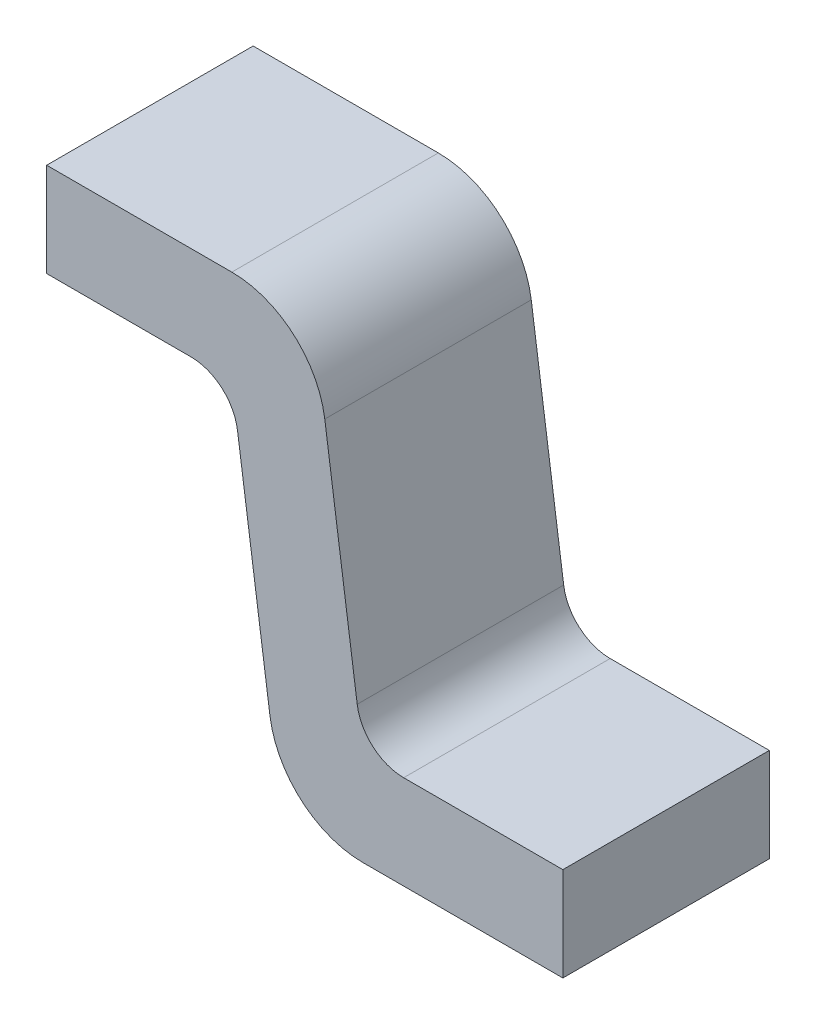
ISO-10303-21;
HEADER;
FILE_DESCRIPTION(('STEP AP214'),'2;1');
FILE_NAME('part.step','',(''),(''),'','','');
FILE_SCHEMA(('AUTOMOTIVE_DESIGN { 1 0 10303 214 1 1 1 1 }'));
ENDSEC;
DATA;
#1=APPLICATION_CONTEXT('core data for automotive mechanical design processes');
#2=APPLICATION_PROTOCOL_DEFINITION('international standard','automotive_design',2000,#1);
#3=PRODUCT_CONTEXT('',#1,'mechanical');
#4=PRODUCT('Part','Part','',(#3));
#5=PRODUCT_RELATED_PRODUCT_CATEGORY('part','',(#4));
#6=PRODUCT_DEFINITION_FORMATION('','',#4);
#7=PRODUCT_DEFINITION_CONTEXT('part definition',#1,'design');
#8=PRODUCT_DEFINITION('design','',#6,#7);
#9=PRODUCT_DEFINITION_SHAPE('','',#8);
#10=(LENGTH_UNIT() NAMED_UNIT(*) SI_UNIT(.MILLI.,.METRE.));
#11=(NAMED_UNIT(*) PLANE_ANGLE_UNIT() SI_UNIT($,.RADIAN.));
#12=(NAMED_UNIT(*) SI_UNIT($,.STERADIAN.) SOLID_ANGLE_UNIT());
#13=UNCERTAINTY_MEASURE_WITH_UNIT(LENGTH_MEASURE(1.E-05),#10,'distance_accuracy_value','');
#14=(GEOMETRIC_REPRESENTATION_CONTEXT(3) GLOBAL_UNCERTAINTY_ASSIGNED_CONTEXT((#13)) GLOBAL_UNIT_ASSIGNED_CONTEXT((#10,
#11,#12)) REPRESENTATION_CONTEXT('',''));
#15=CARTESIAN_POINT('',(0.,0.,0.));
#16=DIRECTION('',(0.,0.,1.));
#17=DIRECTION('',(1.,0.,0.));
#18=AXIS2_PLACEMENT_3D('',#15,#16,#17);
#19=CARTESIAN_POINT('',(0.760786021345,0.3,0.22));
#20=DIRECTION('',(0.,0.,-1.));
#21=DIRECTION('',(-1.,0.,0.));
#22=AXIS2_PLACEMENT_3D('',#19,#20,#21);
#23=PLANE('',#22);
#24=DIRECTION('',(-1.,0.,0.));
#25=VECTOR('',#24,1.);
#26=CARTESIAN_POINT('',(1.1,0.2,0.22));
#27=LINE('',#26,#25);
#28=CARTESIAN_POINT('',(0.760786021345,0.2,0.22));
#29=VERTEX_POINT('',#28);
#30=CARTESIAN_POINT('',(1.1,0.2,0.22));
#31=VERTEX_POINT('',#30);
#32=EDGE_CURVE('E163',#29,#31,#27,.F.);
#33=ORIENTED_EDGE('',*,*,#32,.F.);
#34=CARTESIAN_POINT('',(0.760786021345,0.3,0.22));
#35=DIRECTION('',(0.,0.,1.));
#36=DIRECTION('',(1.,0.,0.));
#37=AXIS2_PLACEMENT_3D('',#34,#35,#36);
#38=CIRCLE('',#37,0.1);
#39=CARTESIAN_POINT('',(0.661759214470982,0.286082689904012,0.22));
#40=VERTEX_POINT('',#39);
#41=EDGE_CURVE('E172',#29,#40,#38,.F.);
#42=ORIENTED_EDGE('',*,*,#41,.T.);
#43=DIRECTION('',(-0.139173100959942,0.990268068741588,0.));
#44=VECTOR('',#43,1.);
#45=CARTESIAN_POINT('',(0.592647987722,0.777834620192,0.22));
#46=LINE('',#45,#44);
#47=CARTESIAN_POINT('',(0.592647987721994,0.777834620192041,0.22));
#48=VERTEX_POINT('',#47);
#49=EDGE_CURVE('E169',#48,#40,#46,.F.);
#50=ORIENTED_EDGE('',*,*,#49,.F.);
#51=CARTESIAN_POINT('',(0.394594373973,0.75,0.22));
#52=DIRECTION('',(0.,0.,1.));
#53=DIRECTION('',(1.,0.,0.));
#54=AXIS2_PLACEMENT_3D('',#51,#52,#53);
#55=CIRCLE('',#54,0.2);
#56=CARTESIAN_POINT('',(0.394594373973,0.95,0.22));
#57=VERTEX_POINT('',#56);
#58=EDGE_CURVE('E205',#57,#48,#55,.F.);
#59=ORIENTED_EDGE('',*,*,#58,.F.);
#60=DIRECTION('',(-1.,0.,0.));
#61=VECTOR('',#60,1.);
#62=CARTESIAN_POINT('',(0.,0.95,0.22));
#63=LINE('',#62,#61);
#64=CARTESIAN_POINT('',(0.,0.95,0.22));
#65=VERTEX_POINT('',#64);
#66=EDGE_CURVE('E129',#65,#57,#63,.F.);
#67=ORIENTED_EDGE('',*,*,#66,.F.);
#68=DIRECTION('',(0.,-1.,0.));
#69=VECTOR('',#68,1.);
#70=CARTESIAN_POINT('',(0.,0.95,0.22));
#71=LINE('',#70,#69);
#72=CARTESIAN_POINT('',(0.,0.75,0.22));
#73=VERTEX_POINT('',#72);
#74=EDGE_CURVE('E127',#73,#65,#71,.F.);
#75=ORIENTED_EDGE('',*,*,#74,.F.);
#76=DIRECTION('',(1.,0.,0.));
#77=VECTOR('',#76,1.);
#78=CARTESIAN_POINT('',(0.307665700192,0.75,0.22));
#79=LINE('',#78,#77);
#80=CARTESIAN_POINT('',(0.307665700192,0.75,0.22));
#81=VERTEX_POINT('',#80);
#82=EDGE_CURVE('E117',#81,#73,#79,.F.);
#83=ORIENTED_EDGE('',*,*,#82,.F.);
#84=CARTESIAN_POINT('',(0.307665700192,0.65,0.22));
#85=DIRECTION('',(0.,0.,1.));
#86=DIRECTION('',(1.,0.,0.));
#87=AXIS2_PLACEMENT_3D('',#84,#85,#86);
#88=CIRCLE('',#87,0.1);
#89=CARTESIAN_POINT('',(0.406692507066018,0.663917310095989,0.22));
#90=VERTEX_POINT('',#89);
#91=EDGE_CURVE('E148',#81,#90,#88,.F.);
#92=ORIENTED_EDGE('',*,*,#91,.T.);
#93=DIRECTION('',(0.139173100959942,-0.990268068741588,0.));
#94=VECTOR('',#93,1.);
#95=CARTESIAN_POINT('',(0.475803733815,0.172165379808,0.22));
#96=LINE('',#95,#94);
#97=CARTESIAN_POINT('',(0.475803733814996,0.172165379808028,0.22));
#98=VERTEX_POINT('',#97);
#99=EDGE_CURVE('E152',#98,#90,#96,.F.);
#100=ORIENTED_EDGE('',*,*,#99,.F.);
#101=CARTESIAN_POINT('',(0.673857347563,0.2,0.22));
#102=DIRECTION('',(0.,0.,1.));
#103=DIRECTION('',(1.,0.,0.));
#104=AXIS2_PLACEMENT_3D('',#101,#102,#103);
#105=CIRCLE('',#104,0.2);
#106=CARTESIAN_POINT('',(0.673857347563,0.,0.22));
#107=VERTEX_POINT('',#106);
#108=EDGE_CURVE('E20',#107,#98,#105,.F.);
#109=ORIENTED_EDGE('',*,*,#108,.F.);
#110=DIRECTION('',(1.,0.,0.));
#111=VECTOR('',#110,1.);
#112=CARTESIAN_POINT('',(0.673857347563,0.,0.22));
#113=LINE('',#112,#111);
#114=CARTESIAN_POINT('',(1.1,0.,0.22));
#115=VERTEX_POINT('',#114);
#116=EDGE_CURVE('E87',#115,#107,#113,.F.);
#117=ORIENTED_EDGE('',*,*,#116,.F.);
#118=DIRECTION('',(0.,1.,0.));
#119=VECTOR('',#118,1.);
#120=CARTESIAN_POINT('',(1.1,0.,0.22));
#121=LINE('',#120,#119);
#122=EDGE_CURVE('E96',#31,#115,#121,.F.);
#123=ORIENTED_EDGE('',*,*,#122,.F.);
#124=EDGE_LOOP('',(#33,#42,#50,#59,#67,#75,#83,#92,#100,#109,#117,#123));
#125=FACE_BOUND('',#124,.T.);
#126=ADVANCED_FACE('F17',(#125),#23,.F.);
#127=CARTESIAN_POINT('',(1.1,0.,-0.22));
#128=DIRECTION('',(1.,0.,0.));
#129=DIRECTION('',(0.,0.,-1.));
#130=AXIS2_PLACEMENT_3D('',#127,#128,#129);
#131=PLANE('',#130);
#132=DIRECTION('',(0.,0.,1.));
#133=VECTOR('',#132,1.);
#134=CARTESIAN_POINT('',(1.1,0.,-0.22));
#135=LINE('',#134,#133);
#136=CARTESIAN_POINT('',(1.1,0.,-0.22));
#137=VERTEX_POINT('',#136);
#138=EDGE_CURVE('E156',#137,#115,#135,.T.);
#139=ORIENTED_EDGE('',*,*,#138,.F.);
#140=DIRECTION('',(0.,1.,0.));
#141=VECTOR('',#140,1.);
#142=CARTESIAN_POINT('',(1.1,0.3,-0.22));
#143=LINE('',#142,#141);
#144=CARTESIAN_POINT('',(1.1,0.2,-0.22));
#145=VERTEX_POINT('',#144);
#146=EDGE_CURVE('E105',#145,#137,#143,.F.);
#147=ORIENTED_EDGE('',*,*,#146,.F.);
#148=DIRECTION('',(0.,0.,1.));
#149=VECTOR('',#148,1.);
#150=CARTESIAN_POINT('',(1.1,0.2,-0.22));
#151=LINE('',#150,#149);
#152=EDGE_CURVE('E166',#31,#145,#151,.F.);
#153=ORIENTED_EDGE('',*,*,#152,.F.);
#154=ORIENTED_EDGE('',*,*,#122,.T.);
#155=EDGE_LOOP('',(#139,#147,#153,#154));
#156=FACE_BOUND('',#155,.T.);
#157=ADVANCED_FACE('F362',(#156),#131,.T.);
#158=CARTESIAN_POINT('',(0.673857347563,0.,-0.22));
#159=DIRECTION('',(0.,-1.,0.));
#160=DIRECTION('',(1.,0.,0.));
#161=AXIS2_PLACEMENT_3D('',#158,#159,#160);
#162=PLANE('',#161);
#163=DIRECTION('',(0.,0.,1.));
#164=VECTOR('',#163,1.);
#165=CARTESIAN_POINT('',(0.673857347563,0.,-0.22));
#166=LINE('',#165,#164);
#167=CARTESIAN_POINT('',(0.673857347563,0.,-0.22));
#168=VERTEX_POINT('',#167);
#169=EDGE_CURVE('E153',#168,#107,#166,.T.);
#170=ORIENTED_EDGE('',*,*,#169,.F.);
#171=DIRECTION('',(-1.,0.,0.));
#172=VECTOR('',#171,1.);
#173=CARTESIAN_POINT('',(0.760786021345,0.,-0.22));
#174=LINE('',#173,#172);
#175=EDGE_CURVE('E202',#137,#168,#174,.T.);
#176=ORIENTED_EDGE('',*,*,#175,.F.);
#177=ORIENTED_EDGE('',*,*,#138,.T.);
#178=ORIENTED_EDGE('',*,*,#116,.T.);
#179=EDGE_LOOP('',(#170,#176,#177,#178));
#180=FACE_BOUND('',#179,.T.);
#181=ADVANCED_FACE('F352',(#180),#162,.T.);
#182=CARTESIAN_POINT('',(0.673857347563,0.2,-0.22));
#183=DIRECTION('',(0.,0.,1.));
#184=DIRECTION('',(1.,0.,0.));
#185=AXIS2_PLACEMENT_3D('',#182,#183,#184);
#186=CYLINDRICAL_SURFACE('',#185,0.2);
#187=DIRECTION('',(0.,0.,1.));
#188=VECTOR('',#187,1.);
#189=CARTESIAN_POINT('',(0.475803733815,0.172165379808,-0.22));
#190=LINE('',#189,#188);
#191=CARTESIAN_POINT('',(0.475803733814993,0.172165379808052,-0.22));
#192=VERTEX_POINT('',#191);
#193=EDGE_CURVE('E149',#192,#98,#190,.T.);
#194=ORIENTED_EDGE('',*,*,#193,.F.);
#195=CARTESIAN_POINT('',(0.673857347563,0.2,-0.22));
#196=DIRECTION('',(0.,0.,1.));
#197=DIRECTION('',(1.,0.,0.));
#198=AXIS2_PLACEMENT_3D('',#195,#196,#197);
#199=CIRCLE('',#198,0.2);
#200=EDGE_CURVE('E199',#168,#192,#199,.F.);
#201=ORIENTED_EDGE('',*,*,#200,.F.);
#202=ORIENTED_EDGE('',*,*,#169,.T.);
#203=ORIENTED_EDGE('',*,*,#108,.T.);
#204=EDGE_LOOP('',(#194,#201,#202,#203));
#205=FACE_BOUND('',#204,.T.);
#206=ADVANCED_FACE('F343',(#205),#186,.T.);
#207=CARTESIAN_POINT('',(0.475803733815,0.172165379808,-0.22));
#208=DIRECTION('',(-0.990268068741588,-0.139173100959942,0.));
#209=DIRECTION('',(0.139173100959942,-0.990268068741588,0.));
#210=AXIS2_PLACEMENT_3D('',#207,#208,#209);
#211=PLANE('',#210);
#212=DIRECTION('',(0.,0.,1.));
#213=VECTOR('',#212,1.);
#214=CARTESIAN_POINT('',(0.406692507066155,0.663917310096022,-0.22));
#215=LINE('',#214,#213);
#216=CARTESIAN_POINT('',(0.406692507066081,0.663917310095985,-0.22));
#217=VERTEX_POINT('',#216);
#218=EDGE_CURVE('E146',#90,#217,#215,.F.);
#219=ORIENTED_EDGE('',*,*,#218,.T.);
#220=DIRECTION('',(-0.139173100959695,0.990268068741622,0.));
#221=VECTOR('',#220,1.);
#222=CARTESIAN_POINT('',(0.475803733815,0.172165379808,-0.22));
#223=LINE('',#222,#221);
#224=EDGE_CURVE('E198',#192,#217,#223,.T.);
#225=ORIENTED_EDGE('',*,*,#224,.F.);
#226=ORIENTED_EDGE('',*,*,#193,.T.);
#227=ORIENTED_EDGE('',*,*,#99,.T.);
#228=EDGE_LOOP('',(#219,#225,#226,#227));
#229=FACE_BOUND('',#228,.T.);
#230=ADVANCED_FACE('F210',(#229),#211,.T.);
#231=CARTESIAN_POINT('',(0.307665700192,0.65,-0.22));
#232=DIRECTION('',(0.,0.,1.));
#233=DIRECTION('',(1.,0.,0.));
#234=AXIS2_PLACEMENT_3D('',#231,#232,#233);
#235=CYLINDRICAL_SURFACE('',#234,0.1);
#236=ORIENTED_EDGE('',*,*,#91,.F.);
#237=DIRECTION('',(0.,0.,-1.));
#238=VECTOR('',#237,1.);
#239=CARTESIAN_POINT('',(0.307665700192,0.75,-0.22));
#240=LINE('',#239,#238);
#241=CARTESIAN_POINT('',(0.307665700192,0.75,-0.22));
#242=VERTEX_POINT('',#241);
#243=EDGE_CURVE('E124',#242,#81,#240,.F.);
#244=ORIENTED_EDGE('',*,*,#243,.F.);
#245=CARTESIAN_POINT('',(0.307665700192,0.65,-0.22));
#246=DIRECTION('',(0.,0.,1.));
#247=DIRECTION('',(1.,0.,0.));
#248=AXIS2_PLACEMENT_3D('',#245,#246,#247);
#249=CIRCLE('',#248,0.1);
#250=EDGE_CURVE('E194',#217,#242,#249,.T.);
#251=ORIENTED_EDGE('',*,*,#250,.F.);
#252=ORIENTED_EDGE('',*,*,#218,.F.);
#253=EDGE_LOOP('',(#236,#244,#251,#252));
#254=FACE_BOUND('',#253,.T.);
#255=ADVANCED_FACE('F213',(#254),#235,.F.);
#256=CARTESIAN_POINT('',(0.307665700192,0.75,-0.22));
#257=DIRECTION('',(0.,-1.,0.));
#258=DIRECTION('',(0.,0.,-1.));
#259=AXIS2_PLACEMENT_3D('',#256,#257,#258);
#260=PLANE('',#259);
#261=DIRECTION('',(0.,0.,1.));
#262=VECTOR('',#261,1.);
#263=CARTESIAN_POINT('',(0.,0.75,-0.22));
#264=LINE('',#263,#262);
#265=CARTESIAN_POINT('',(0.,0.75,-0.22));
#266=VERTEX_POINT('',#265);
#267=EDGE_CURVE('E122',#266,#73,#264,.T.);
#268=ORIENTED_EDGE('',*,*,#267,.F.);
#269=DIRECTION('',(-1.,0.,0.));
#270=VECTOR('',#269,1.);
#271=CARTESIAN_POINT('',(0.760786021345,0.75,-0.22));
#272=LINE('',#271,#270);
#273=EDGE_CURVE('E197',#242,#266,#272,.T.);
#274=ORIENTED_EDGE('',*,*,#273,.F.);
#275=ORIENTED_EDGE('',*,*,#243,.T.);
#276=ORIENTED_EDGE('',*,*,#82,.T.);
#277=EDGE_LOOP('',(#268,#274,#275,#276));
#278=FACE_BOUND('',#277,.T.);
#279=ADVANCED_FACE('F119',(#278),#260,.T.);
#280=CARTESIAN_POINT('',(0.,0.95,-0.22));
#281=DIRECTION('',(-1.,0.,0.));
#282=DIRECTION('',(0.,-1.,0.));
#283=AXIS2_PLACEMENT_3D('',#280,#281,#282);
#284=PLANE('',#283);
#285=DIRECTION('',(0.,0.,1.));
#286=VECTOR('',#285,1.);
#287=CARTESIAN_POINT('',(0.,0.95,-0.22));
#288=LINE('',#287,#286);
#289=CARTESIAN_POINT('',(0.,0.95,-0.22));
#290=VERTEX_POINT('',#289);
#291=EDGE_CURVE('E132',#290,#65,#288,.T.);
#292=ORIENTED_EDGE('',*,*,#291,.F.);
#293=DIRECTION('',(0.,1.,0.));
#294=VECTOR('',#293,1.);
#295=CARTESIAN_POINT('',(0.,0.3,-0.22));
#296=LINE('',#295,#294);
#297=EDGE_CURVE('E136',#266,#290,#296,.T.);
#298=ORIENTED_EDGE('',*,*,#297,.F.);
#299=ORIENTED_EDGE('',*,*,#267,.T.);
#300=ORIENTED_EDGE('',*,*,#74,.T.);
#301=EDGE_LOOP('',(#292,#298,#299,#300));
#302=FACE_BOUND('',#301,.T.);
#303=ADVANCED_FACE('F134',(#302),#284,.T.);
#304=CARTESIAN_POINT('',(0.,0.95,-0.22));
#305=DIRECTION('',(0.,1.,0.));
#306=DIRECTION('',(-1.,0.,0.));
#307=AXIS2_PLACEMENT_3D('',#304,#305,#306);
#308=PLANE('',#307);
#309=DIRECTION('',(0.,0.,1.));
#310=VECTOR('',#309,1.);
#311=CARTESIAN_POINT('',(0.394594373973,0.95,-0.22));
#312=LINE('',#311,#310);
#313=CARTESIAN_POINT('',(0.394594373973,0.95,-0.22));
#314=VERTEX_POINT('',#313);
#315=EDGE_CURVE('E175',#314,#57,#312,.T.);
#316=ORIENTED_EDGE('',*,*,#315,.F.);
#317=DIRECTION('',(-1.,0.,0.));
#318=VECTOR('',#317,1.);
#319=CARTESIAN_POINT('',(0.760786021345,0.95,-0.22));
#320=LINE('',#319,#318);
#321=EDGE_CURVE('E193',#290,#314,#320,.F.);
#322=ORIENTED_EDGE('',*,*,#321,.F.);
#323=ORIENTED_EDGE('',*,*,#291,.T.);
#324=ORIENTED_EDGE('',*,*,#66,.T.);
#325=EDGE_LOOP('',(#316,#322,#323,#324));
#326=FACE_BOUND('',#325,.T.);
#327=ADVANCED_FACE('F300',(#326),#308,.T.);
#328=CARTESIAN_POINT('',(0.394594373973,0.75,-0.22));
#329=DIRECTION('',(0.,0.,1.));
#330=DIRECTION('',(1.,0.,0.));
#331=AXIS2_PLACEMENT_3D('',#328,#329,#330);
#332=CYLINDRICAL_SURFACE('',#331,0.2);
#333=DIRECTION('',(0.,0.,1.));
#334=VECTOR('',#333,1.);
#335=CARTESIAN_POINT('',(0.592647987722,0.777834620192,-0.22));
#336=LINE('',#335,#334);
#337=CARTESIAN_POINT('',(0.592647987721998,0.777834620192017,-0.22));
#338=VERTEX_POINT('',#337);
#339=EDGE_CURVE('E173',#338,#48,#336,.T.);
#340=ORIENTED_EDGE('',*,*,#339,.F.);
#341=CARTESIAN_POINT('',(0.394594373973,0.75,-0.22));
#342=DIRECTION('',(0.,0.,1.));
#343=DIRECTION('',(1.,0.,0.));
#344=AXIS2_PLACEMENT_3D('',#341,#342,#343);
#345=CIRCLE('',#344,0.2);
#346=EDGE_CURVE('E190',#314,#338,#345,.F.);
#347=ORIENTED_EDGE('',*,*,#346,.F.);
#348=ORIENTED_EDGE('',*,*,#315,.T.);
#349=ORIENTED_EDGE('',*,*,#58,.T.);
#350=EDGE_LOOP('',(#340,#347,#348,#349));
#351=FACE_BOUND('',#350,.T.);
#352=ADVANCED_FACE('F266',(#351),#332,.T.);
#353=CARTESIAN_POINT('',(0.592647987722,0.777834620192,-0.22));
#354=DIRECTION('',(0.990268068741588,0.139173100959942,0.));
#355=DIRECTION('',(-0.139173100959942,0.990268068741588,0.));
#356=AXIS2_PLACEMENT_3D('',#353,#354,#355);
#357=PLANE('',#356);
#358=DIRECTION('',(0.,0.,1.));
#359=VECTOR('',#358,1.);
#360=CARTESIAN_POINT('',(0.661759214470845,0.286082689903978,-0.22));
#361=LINE('',#360,#359);
#362=CARTESIAN_POINT('',(0.661759214470919,0.286082689904015,-0.22));
#363=VERTEX_POINT('',#362);
#364=EDGE_CURVE('E204',#40,#363,#361,.F.);
#365=ORIENTED_EDGE('',*,*,#364,.T.);
#366=DIRECTION('',(0.139173100959695,-0.990268068741622,0.));
#367=VECTOR('',#366,1.);
#368=CARTESIAN_POINT('',(0.592647987722,0.777834620192,-0.22));
#369=LINE('',#368,#367);
#370=EDGE_CURVE('E189',#338,#363,#369,.T.);
#371=ORIENTED_EDGE('',*,*,#370,.F.);
#372=ORIENTED_EDGE('',*,*,#339,.T.);
#373=ORIENTED_EDGE('',*,*,#49,.T.);
#374=EDGE_LOOP('',(#365,#371,#372,#373));
#375=FACE_BOUND('',#374,.T.);
#376=ADVANCED_FACE('F252',(#375),#357,.T.);
#377=CARTESIAN_POINT('',(0.760786021345,0.3,-0.22));
#378=DIRECTION('',(0.,0.,1.));
#379=DIRECTION('',(1.,0.,0.));
#380=AXIS2_PLACEMENT_3D('',#377,#378,#379);
#381=CYLINDRICAL_SURFACE('',#380,0.1);
#382=ORIENTED_EDGE('',*,*,#41,.F.);
#383=DIRECTION('',(0.,0.,1.));
#384=VECTOR('',#383,1.);
#385=CARTESIAN_POINT('',(0.760786021345,0.2,-0.22));
#386=LINE('',#385,#384);
#387=CARTESIAN_POINT('',(0.760786021345,0.2,-0.22));
#388=VERTEX_POINT('',#387);
#389=EDGE_CURVE('E35',#388,#29,#386,.T.);
#390=ORIENTED_EDGE('',*,*,#389,.F.);
#391=CARTESIAN_POINT('',(0.760786021345,0.3,-0.22));
#392=DIRECTION('',(0.,0.,1.));
#393=DIRECTION('',(1.,0.,0.));
#394=AXIS2_PLACEMENT_3D('',#391,#392,#393);
#395=CIRCLE('',#394,0.1);
#396=EDGE_CURVE('E26',#363,#388,#395,.T.);
#397=ORIENTED_EDGE('',*,*,#396,.F.);
#398=ORIENTED_EDGE('',*,*,#364,.F.);
#399=EDGE_LOOP('',(#382,#390,#397,#398));
#400=FACE_BOUND('',#399,.T.);
#401=ADVANCED_FACE('F255',(#400),#381,.F.);
#402=CARTESIAN_POINT('',(1.1,0.2,-0.22));
#403=DIRECTION('',(0.,1.,0.));
#404=DIRECTION('',(-1.,0.,0.));
#405=AXIS2_PLACEMENT_3D('',#402,#403,#404);
#406=PLANE('',#405);
#407=ORIENTED_EDGE('',*,*,#152,.T.);
#408=DIRECTION('',(-1.,0.,0.));
#409=VECTOR('',#408,1.);
#410=CARTESIAN_POINT('',(0.760786021345,0.2,-0.22));
#411=LINE('',#410,#409);
#412=EDGE_CURVE('E11',#388,#145,#411,.F.);
#413=ORIENTED_EDGE('',*,*,#412,.F.);
#414=ORIENTED_EDGE('',*,*,#389,.T.);
#415=ORIENTED_EDGE('',*,*,#32,.T.);
#416=EDGE_LOOP('',(#407,#413,#414,#415));
#417=FACE_BOUND('',#416,.T.);
#418=ADVANCED_FACE('F257',(#417),#406,.T.);
#419=CARTESIAN_POINT('',(0.760786021345,0.3,-0.22));
#420=DIRECTION('',(0.,0.,-1.));
#421=DIRECTION('',(-1.,0.,0.));
#422=AXIS2_PLACEMENT_3D('',#419,#420,#421);
#423=PLANE('',#422);
#424=ORIENTED_EDGE('',*,*,#396,.T.);
#425=ORIENTED_EDGE('',*,*,#412,.T.);
#426=ORIENTED_EDGE('',*,*,#146,.T.);
#427=ORIENTED_EDGE('',*,*,#175,.T.);
#428=ORIENTED_EDGE('',*,*,#200,.T.);
#429=ORIENTED_EDGE('',*,*,#224,.T.);
#430=ORIENTED_EDGE('',*,*,#250,.T.);
#431=ORIENTED_EDGE('',*,*,#273,.T.);
#432=ORIENTED_EDGE('',*,*,#297,.T.);
#433=ORIENTED_EDGE('',*,*,#321,.T.);
#434=ORIENTED_EDGE('',*,*,#346,.T.);
#435=ORIENTED_EDGE('',*,*,#370,.T.);
#436=EDGE_LOOP('',(#424,#425,#426,#427,#428,#429,#430,#431,#432,#433,#434,#435));
#437=FACE_BOUND('',#436,.T.);
#438=ADVANCED_FACE('F216',(#437),#423,.T.);
#439=CLOSED_SHELL('',(#126,#157,#181,#206,#230,#255,#279,#303,#327,#352,#376,#401,#418,#438));
#440=MANIFOLD_SOLID_BREP('B1',#439);
#441=ADVANCED_BREP_SHAPE_REPRESENTATION('',(#18,#440),#14);
#442=SHAPE_DEFINITION_REPRESENTATION(#9,#441);
ENDSEC;
END-ISO-10303-21;
